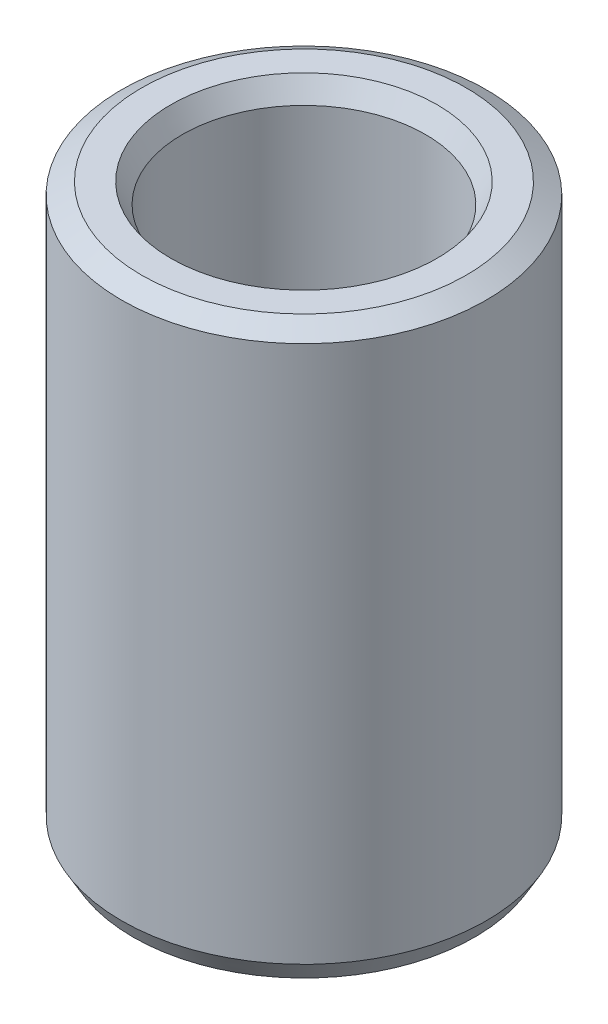
ISO-10303-21;
HEADER;
FILE_DESCRIPTION(('STEP AP214'),'2;1');
FILE_NAME('part.step','',(''),(''),'','','');
FILE_SCHEMA(('AUTOMOTIVE_DESIGN { 1 0 10303 214 1 1 1 1 }'));
ENDSEC;
DATA;
#1=APPLICATION_CONTEXT('core data for automotive mechanical design processes');
#2=APPLICATION_PROTOCOL_DEFINITION('international standard','automotive_design',2000,#1);
#3=PRODUCT_CONTEXT('',#1,'mechanical');
#4=PRODUCT('Part','Part','',(#3));
#5=PRODUCT_RELATED_PRODUCT_CATEGORY('part','',(#4));
#6=PRODUCT_DEFINITION_FORMATION('','',#4);
#7=PRODUCT_DEFINITION_CONTEXT('part definition',#1,'design');
#8=PRODUCT_DEFINITION('design','',#6,#7);
#9=PRODUCT_DEFINITION_SHAPE('','',#8);
#10=(LENGTH_UNIT() NAMED_UNIT(*) SI_UNIT(.MILLI.,.METRE.));
#11=(NAMED_UNIT(*) PLANE_ANGLE_UNIT() SI_UNIT($,.RADIAN.));
#12=(NAMED_UNIT(*) SI_UNIT($,.STERADIAN.) SOLID_ANGLE_UNIT());
#13=UNCERTAINTY_MEASURE_WITH_UNIT(LENGTH_MEASURE(1.E-05),#10,'distance_accuracy_value','');
#14=(GEOMETRIC_REPRESENTATION_CONTEXT(3) GLOBAL_UNCERTAINTY_ASSIGNED_CONTEXT((#13)) GLOBAL_UNIT_ASSIGNED_CONTEXT((#10,
#11,#12)) REPRESENTATION_CONTEXT('',''));
#15=CARTESIAN_POINT('',(0.,0.,0.));
#16=DIRECTION('',(0.,0.,1.));
#17=DIRECTION('',(1.,0.,0.));
#18=AXIS2_PLACEMENT_3D('',#15,#16,#17);
#19=CARTESIAN_POINT('',(0.,54.6245709073706,0.));
#20=DIRECTION('',(0.,-1.,0.));
#21=DIRECTION('',(0.,0.,-1.));
#22=AXIS2_PLACEMENT_3D('',#19,#20,#21);
#23=CYLINDRICAL_SURFACE('',#22,17.5);
#24=CARTESIAN_POINT('',(0.,1.92173335928457,0.));
#25=DIRECTION('',(0.,1.,0.));
#26=DIRECTION('',(0.,0.,1.));
#27=AXIS2_PLACEMENT_3D('',#24,#25,#26);
#28=CIRCLE('',#27,17.5);
#29=CARTESIAN_POINT('',(0.,1.92173335928457,17.5));
#30=VERTEX_POINT('',#29);
#31=EDGE_CURVE('E10',#30,#30,#28,.T.);
#32=ORIENTED_EDGE('',*,*,#31,.T.);
#33=EDGE_LOOP('',(#32));
#34=FACE_BOUND('',#33,.T.);
#35=CARTESIAN_POINT('',(0.,53.515057635077,0.));
#36=DIRECTION('',(0.,1.,0.));
#37=DIRECTION('',(0.,0.,1.));
#38=AXIS2_PLACEMENT_3D('',#35,#36,#37);
#39=CIRCLE('',#38,17.5);
#40=CARTESIAN_POINT('',(0.,53.515057635077,17.5));
#41=VERTEX_POINT('',#40);
#42=EDGE_CURVE('E50',#41,#41,#39,.F.);
#43=ORIENTED_EDGE('',*,*,#42,.T.);
#44=EDGE_LOOP('',(#43));
#45=FACE_BOUND('',#44,.T.);
#46=ADVANCED_FACE('F39',(#34,#45),#23,.T.);
#47=CARTESIAN_POINT('',(0.,54.6245709073706,0.));
#48=DIRECTION('',(0.,1.,0.));
#49=DIRECTION('',(0.,0.,1.));
#50=AXIS2_PLACEMENT_3D('',#47,#48,#49);
#51=PLANE('',#50);
#52=CARTESIAN_POINT('',(0.,54.6245709073706,0.));
#53=DIRECTION('',(0.,1.,0.));
#54=DIRECTION('',(0.,0.,1.));
#55=AXIS2_PLACEMENT_3D('',#52,#53,#54);
#56=CIRCLE('',#55,12.7790333767046);
#57=CARTESIAN_POINT('',(0.,54.6245709073706,12.7790333767046));
#58=VERTEX_POINT('',#57);
#59=EDGE_CURVE('E58',#58,#58,#56,.F.);
#60=ORIENTED_EDGE('',*,*,#59,.T.);
#61=EDGE_LOOP('',(#60));
#62=FACE_BOUND('',#61,.T.);
#63=CARTESIAN_POINT('',(0.,54.6245709073706,0.));
#64=DIRECTION('',(0.,1.,0.));
#65=DIRECTION('',(0.,0.,1.));
#66=AXIS2_PLACEMENT_3D('',#63,#64,#65);
#67=CIRCLE('',#66,15.5782666407154);
#68=CARTESIAN_POINT('',(0.,54.6245709073706,15.5782666407154));
#69=VERTEX_POINT('',#68);
#70=EDGE_CURVE('E61',#69,#69,#67,.T.);
#71=ORIENTED_EDGE('',*,*,#70,.T.);
#72=EDGE_LOOP('',(#71));
#73=FACE_BOUND('',#72,.T.);
#74=ADVANCED_FACE('F88',(#62,#73),#51,.T.);
#75=CARTESIAN_POINT('',(0.,0.,0.));
#76=DIRECTION('',(0.,1.,0.));
#77=DIRECTION('',(0.,0.,1.));
#78=AXIS2_PLACEMENT_3D('',#75,#76,#77);
#79=PLANE('',#78);
#80=CARTESIAN_POINT('',(0.,0.,0.));
#81=DIRECTION('',(0.,1.,0.));
#82=DIRECTION('',(0.,0.,1.));
#83=AXIS2_PLACEMENT_3D('',#80,#81,#82);
#84=CIRCLE('',#83,13.5912534636955);
#85=CARTESIAN_POINT('',(0.,0.,13.5912534636955));
#86=VERTEX_POINT('',#85);
#87=EDGE_CURVE('E51',#86,#86,#84,.T.);
#88=ORIENTED_EDGE('',*,*,#87,.T.);
#89=EDGE_LOOP('',(#88));
#90=FACE_BOUND('',#89,.T.);
#91=CARTESIAN_POINT('',(0.,0.,0.));
#92=DIRECTION('',(0.,1.,0.));
#93=DIRECTION('',(0.,0.,1.));
#94=AXIS2_PLACEMENT_3D('',#91,#92,#93);
#95=CIRCLE('',#94,16.3904867277064);
#96=CARTESIAN_POINT('',(0.,0.,16.3904867277064));
#97=VERTEX_POINT('',#96);
#98=EDGE_CURVE('E54',#97,#97,#95,.F.);
#99=ORIENTED_EDGE('',*,*,#98,.T.);
#100=EDGE_LOOP('',(#99));
#101=FACE_BOUND('',#100,.T.);
#102=ADVANCED_FACE('F83',(#90,#101),#79,.F.);
#103=CARTESIAN_POINT('',(0.,54.6245709073706,0.));
#104=DIRECTION('',(0.,-1.,0.));
#105=DIRECTION('',(0.,0.,-1.));
#106=AXIS2_PLACEMENT_3D('',#103,#104,#105);
#107=CYLINDRICAL_SURFACE('',#106,11.669520104411);
#108=CARTESIAN_POINT('',(0.,52.7028375480861,0.));
#109=DIRECTION('',(0.,1.,0.));
#110=DIRECTION('',(0.,0.,1.));
#111=AXIS2_PLACEMENT_3D('',#108,#109,#110);
#112=CIRCLE('',#111,11.669520104411);
#113=CARTESIAN_POINT('',(0.,52.7028375480861,11.669520104411));
#114=VERTEX_POINT('',#113);
#115=EDGE_CURVE('E67',#114,#114,#112,.T.);
#116=ORIENTED_EDGE('',*,*,#115,.T.);
#117=EDGE_LOOP('',(#116));
#118=FACE_BOUND('',#117,.T.);
#119=CARTESIAN_POINT('',(0.,1.10951327229364,0.));
#120=DIRECTION('',(0.,1.,0.));
#121=DIRECTION('',(0.,0.,1.));
#122=AXIS2_PLACEMENT_3D('',#119,#120,#121);
#123=CIRCLE('',#122,11.669520104411);
#124=CARTESIAN_POINT('',(0.,1.10951327229364,11.669520104411));
#125=VERTEX_POINT('',#124);
#126=EDGE_CURVE('E69',#125,#125,#123,.F.);
#127=ORIENTED_EDGE('',*,*,#126,.T.);
#128=EDGE_LOOP('',(#127));
#129=FACE_BOUND('',#128,.T.);
#130=ADVANCED_FACE('F71',(#118,#129),#107,.F.);
#131=CARTESIAN_POINT('',(0.,52.7028375480861,0.));
#132=DIRECTION('',(0.,1.,0.));
#133=DIRECTION('',(0.,0.,1.));
#134=AXIS2_PLACEMENT_3D('',#131,#132,#133);
#135=CONICAL_SURFACE('',#134,11.669520104411,0.523598775598305);
#136=ORIENTED_EDGE('',*,*,#59,.F.);
#137=EDGE_LOOP('',(#136));
#138=FACE_BOUND('',#137,.T.);
#139=ORIENTED_EDGE('',*,*,#115,.F.);
#140=EDGE_LOOP('',(#139));
#141=FACE_BOUND('',#140,.T.);
#142=ADVANCED_FACE('F77',(#138,#141),#135,.F.);
#143=CARTESIAN_POINT('',(0.,0.,0.));
#144=DIRECTION('',(0.,-1.,0.));
#145=DIRECTION('',(0.,0.,-1.));
#146=AXIS2_PLACEMENT_3D('',#143,#144,#145);
#147=CONICAL_SURFACE('',#146,13.5912534636955,1.04719755119659);
#148=ORIENTED_EDGE('',*,*,#126,.F.);
#149=EDGE_LOOP('',(#148));
#150=FACE_BOUND('',#149,.T.);
#151=ORIENTED_EDGE('',*,*,#87,.F.);
#152=EDGE_LOOP('',(#151));
#153=FACE_BOUND('',#152,.T.);
#154=ADVANCED_FACE('F73',(#150,#153),#147,.F.);
#155=CARTESIAN_POINT('',(0.,1.92173335928457,0.));
#156=DIRECTION('',(0.,1.,0.));
#157=DIRECTION('',(0.,0.,1.));
#158=AXIS2_PLACEMENT_3D('',#155,#156,#157);
#159=CONICAL_SURFACE('',#158,17.5,0.523598775598304);
#160=ORIENTED_EDGE('',*,*,#98,.F.);
#161=EDGE_LOOP('',(#160));
#162=FACE_BOUND('',#161,.T.);
#163=ORIENTED_EDGE('',*,*,#31,.F.);
#164=EDGE_LOOP('',(#163));
#165=FACE_BOUND('',#164,.T.);
#166=ADVANCED_FACE('F76',(#162,#165),#159,.T.);
#167=CARTESIAN_POINT('',(0.,54.6245709073706,0.));
#168=DIRECTION('',(0.,-1.,0.));
#169=DIRECTION('',(0.,0.,-1.));
#170=AXIS2_PLACEMENT_3D('',#167,#168,#169);
#171=CONICAL_SURFACE('',#170,15.5782666407154,1.0471975511966);
#172=ORIENTED_EDGE('',*,*,#42,.F.);
#173=EDGE_LOOP('',(#172));
#174=FACE_BOUND('',#173,.T.);
#175=ORIENTED_EDGE('',*,*,#70,.F.);
#176=EDGE_LOOP('',(#175));
#177=FACE_BOUND('',#176,.T.);
#178=ADVANCED_FACE('F45',(#174,#177),#171,.T.);
#179=CLOSED_SHELL('',(#46,#74,#102,#130,#142,#154,#166,#178));
#180=MANIFOLD_SOLID_BREP('B2',#179);
#181=ADVANCED_BREP_SHAPE_REPRESENTATION('',(#18,#180),#14);
#182=SHAPE_DEFINITION_REPRESENTATION(#9,#181);
ENDSEC;
END-ISO-10303-21;
